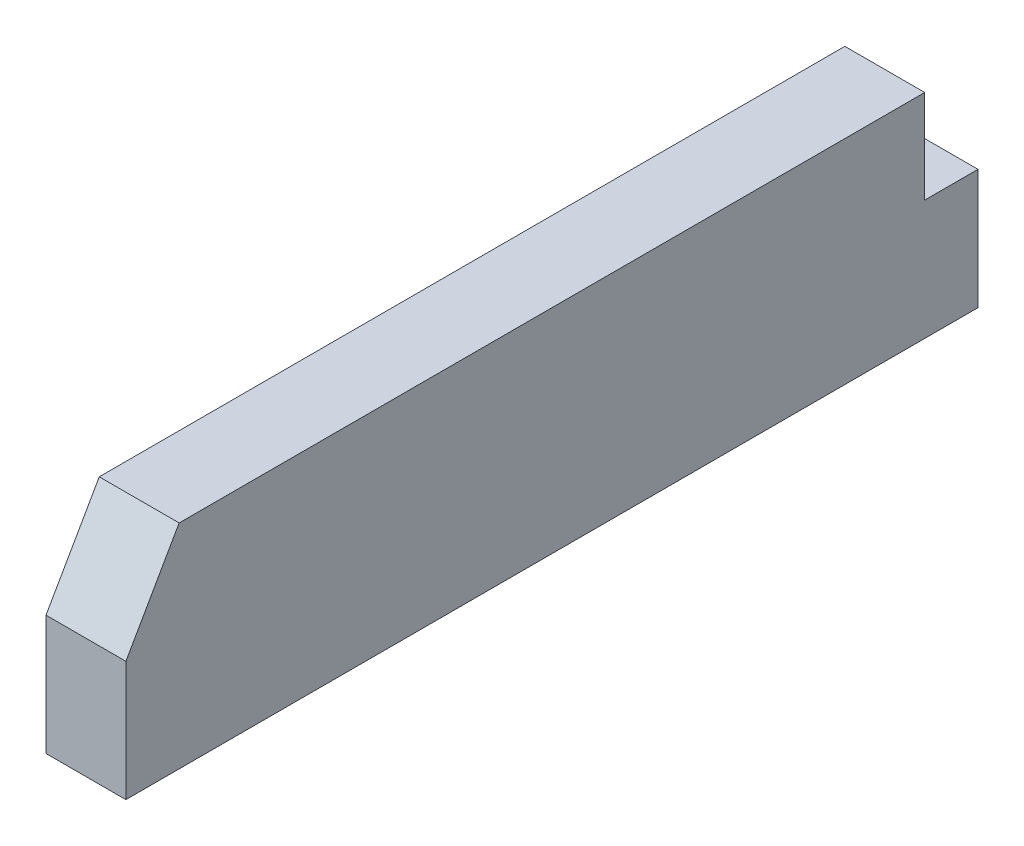
ISO-10303-21;
HEADER;
FILE_DESCRIPTION(('STEP AP214'),'2;1');
FILE_NAME('part.step','',(''),(''),'','','');
FILE_SCHEMA(('AUTOMOTIVE_DESIGN { 1 0 10303 214 1 1 1 1 }'));
ENDSEC;
DATA;
#1=APPLICATION_CONTEXT('core data for automotive mechanical design processes');
#2=APPLICATION_PROTOCOL_DEFINITION('international standard','automotive_design',2000,#1);
#3=PRODUCT_CONTEXT('',#1,'mechanical');
#4=PRODUCT('Part','Part','',(#3));
#5=PRODUCT_RELATED_PRODUCT_CATEGORY('part','',(#4));
#6=PRODUCT_DEFINITION_FORMATION('','',#4);
#7=PRODUCT_DEFINITION_CONTEXT('part definition',#1,'design');
#8=PRODUCT_DEFINITION('design','',#6,#7);
#9=PRODUCT_DEFINITION_SHAPE('','',#8);
#10=(LENGTH_UNIT() NAMED_UNIT(*) SI_UNIT(.MILLI.,.METRE.));
#11=(NAMED_UNIT(*) PLANE_ANGLE_UNIT() SI_UNIT($,.RADIAN.));
#12=(NAMED_UNIT(*) SI_UNIT($,.STERADIAN.) SOLID_ANGLE_UNIT());
#13=UNCERTAINTY_MEASURE_WITH_UNIT(LENGTH_MEASURE(1.E-05),#10,'distance_accuracy_value','');
#14=(GEOMETRIC_REPRESENTATION_CONTEXT(3) GLOBAL_UNCERTAINTY_ASSIGNED_CONTEXT((#13)) GLOBAL_UNIT_ASSIGNED_CONTEXT((#10,
#11,#12)) REPRESENTATION_CONTEXT('',''));
#15=CARTESIAN_POINT('',(0.,0.,0.));
#16=DIRECTION('',(0.,0.,1.));
#17=DIRECTION('',(1.,0.,0.));
#18=AXIS2_PLACEMENT_3D('',#15,#16,#17);
#19=CARTESIAN_POINT('',(9.525,-11.1125,0.));
#20=DIRECTION('',(0.,0.,1.));
#21=DIRECTION('',(1.,0.,0.));
#22=AXIS2_PLACEMENT_3D('',#19,#20,#21);
#23=PLANE('',#22);
#24=DIRECTION('',(0.,1.,0.));
#25=VECTOR('',#24,1.);
#26=CARTESIAN_POINT('',(0.,-11.1125,0.));
#27=LINE('',#26,#25);
#28=CARTESIAN_POINT('',(0.,-11.1125,0.));
#29=VERTEX_POINT('',#28);
#30=CARTESIAN_POINT('',(0.,0.,0.));
#31=VERTEX_POINT('',#30);
#32=EDGE_CURVE('E134',#29,#31,#27,.T.);
#33=ORIENTED_EDGE('',*,*,#32,.T.);
#34=DIRECTION('',(-1.,0.,0.));
#35=VECTOR('',#34,1.);
#36=CARTESIAN_POINT('',(9.525,0.,0.));
#37=LINE('',#36,#35);
#38=CARTESIAN_POINT('',(9.525,0.,0.));
#39=VERTEX_POINT('',#38);
#40=EDGE_CURVE('E11',#39,#31,#37,.T.);
#41=ORIENTED_EDGE('',*,*,#40,.F.);
#42=DIRECTION('',(0.,1.,0.));
#43=VECTOR('',#42,1.);
#44=CARTESIAN_POINT('',(9.525,-11.1125,0.));
#45=LINE('',#44,#43);
#46=CARTESIAN_POINT('',(9.525,-11.1125,0.));
#47=VERTEX_POINT('',#46);
#48=EDGE_CURVE('E153',#47,#39,#45,.T.);
#49=ORIENTED_EDGE('',*,*,#48,.F.);
#50=DIRECTION('',(-1.,0.,0.));
#51=VECTOR('',#50,1.);
#52=CARTESIAN_POINT('',(9.525,-11.1125,0.));
#53=LINE('',#52,#51);
#54=EDGE_CURVE('E130',#47,#29,#53,.T.);
#55=ORIENTED_EDGE('',*,*,#54,.T.);
#56=EDGE_LOOP('',(#33,#41,#49,#55));
#57=FACE_BOUND('',#56,.T.);
#58=ADVANCED_FACE('F39',(#57),#23,.F.);
#59=CARTESIAN_POINT('',(9.525,0.,0.));
#60=DIRECTION('',(0.,-1.,0.));
#61=DIRECTION('',(0.,0.,-1.));
#62=AXIS2_PLACEMENT_3D('',#59,#60,#61);
#63=PLANE('',#62);
#64=DIRECTION('',(0.,0.,1.));
#65=VECTOR('',#64,1.);
#66=CARTESIAN_POINT('',(0.,0.,0.));
#67=LINE('',#66,#65);
#68=CARTESIAN_POINT('',(0.,0.,88.9));
#69=VERTEX_POINT('',#68);
#70=EDGE_CURVE('E138',#31,#69,#67,.T.);
#71=ORIENTED_EDGE('',*,*,#70,.T.);
#72=DIRECTION('',(-1.,0.,0.));
#73=VECTOR('',#72,1.);
#74=CARTESIAN_POINT('',(9.525,0.,88.9));
#75=LINE('',#74,#73);
#76=CARTESIAN_POINT('',(9.525,0.,88.9));
#77=VERTEX_POINT('',#76);
#78=EDGE_CURVE('E48',#77,#69,#75,.T.);
#79=ORIENTED_EDGE('',*,*,#78,.F.);
#80=DIRECTION('',(0.,0.,1.));
#81=VECTOR('',#80,1.);
#82=CARTESIAN_POINT('',(9.525,0.,0.));
#83=LINE('',#82,#81);
#84=EDGE_CURVE('E96',#39,#77,#83,.T.);
#85=ORIENTED_EDGE('',*,*,#84,.F.);
#86=ORIENTED_EDGE('',*,*,#40,.T.);
#87=EDGE_LOOP('',(#71,#79,#85,#86));
#88=FACE_BOUND('',#87,.T.);
#89=ADVANCED_FACE('F187',(#88),#63,.F.);
#90=CARTESIAN_POINT('',(9.525,0.,88.9));
#91=DIRECTION('',(0.,-0.496138938356833,-0.868243142124459));
#92=DIRECTION('',(0.,0.868243142124459,-0.496138938356833));
#93=AXIS2_PLACEMENT_3D('',#90,#91,#92);
#94=PLANE('',#93);
#95=DIRECTION('',(0.,-0.86824314212446,0.496138938356834));
#96=VECTOR('',#95,1.);
#97=CARTESIAN_POINT('',(0.,0.,88.9));
#98=LINE('',#97,#96);
#99=CARTESIAN_POINT('',(0.,-11.1125,95.25));
#100=VERTEX_POINT('',#99);
#101=EDGE_CURVE('E141',#69,#100,#98,.T.);
#102=ORIENTED_EDGE('',*,*,#101,.T.);
#103=DIRECTION('',(-1.,0.,0.));
#104=VECTOR('',#103,1.);
#105=CARTESIAN_POINT('',(9.525,-11.1125,95.25));
#106=LINE('',#105,#104);
#107=CARTESIAN_POINT('',(9.525,-11.1125,95.25));
#108=VERTEX_POINT('',#107);
#109=EDGE_CURVE('E160',#108,#100,#106,.T.);
#110=ORIENTED_EDGE('',*,*,#109,.F.);
#111=DIRECTION('',(0.,-0.86824314212446,0.496138938356834));
#112=VECTOR('',#111,1.);
#113=CARTESIAN_POINT('',(9.525,0.,88.9));
#114=LINE('',#113,#112);
#115=EDGE_CURVE('E170',#77,#108,#114,.T.);
#116=ORIENTED_EDGE('',*,*,#115,.F.);
#117=ORIENTED_EDGE('',*,*,#78,.T.);
#118=EDGE_LOOP('',(#102,#110,#116,#117));
#119=FACE_BOUND('',#118,.T.);
#120=ADVANCED_FACE('F168',(#119),#94,.F.);
#121=CARTESIAN_POINT('',(9.525,-11.1125,95.25));
#122=DIRECTION('',(0.,0.,-1.));
#123=DIRECTION('',(-1.,0.,0.));
#124=AXIS2_PLACEMENT_3D('',#121,#122,#123);
#125=PLANE('',#124);
#126=DIRECTION('',(0.,-1.,0.));
#127=VECTOR('',#126,1.);
#128=CARTESIAN_POINT('',(0.,-11.1125,95.25));
#129=LINE('',#128,#127);
#130=CARTESIAN_POINT('',(0.,-25.4,95.25));
#131=VERTEX_POINT('',#130);
#132=EDGE_CURVE('E144',#100,#131,#129,.T.);
#133=ORIENTED_EDGE('',*,*,#132,.T.);
#134=DIRECTION('',(-1.,0.,0.));
#135=VECTOR('',#134,1.);
#136=CARTESIAN_POINT('',(9.525,-25.4,95.25));
#137=LINE('',#136,#135);
#138=CARTESIAN_POINT('',(9.525,-25.4,95.25));
#139=VERTEX_POINT('',#138);
#140=EDGE_CURVE('E123',#139,#131,#137,.T.);
#141=ORIENTED_EDGE('',*,*,#140,.F.);
#142=DIRECTION('',(0.,-1.,0.));
#143=VECTOR('',#142,1.);
#144=CARTESIAN_POINT('',(9.525,-11.1125,95.25));
#145=LINE('',#144,#143);
#146=EDGE_CURVE('E112',#108,#139,#145,.T.);
#147=ORIENTED_EDGE('',*,*,#146,.F.);
#148=ORIENTED_EDGE('',*,*,#109,.T.);
#149=EDGE_LOOP('',(#133,#141,#147,#148));
#150=FACE_BOUND('',#149,.T.);
#151=ADVANCED_FACE('F176',(#150),#125,.F.);
#152=CARTESIAN_POINT('',(9.525,-25.4,95.25));
#153=DIRECTION('',(0.,1.,0.));
#154=DIRECTION('',(0.,0.,1.));
#155=AXIS2_PLACEMENT_3D('',#152,#153,#154);
#156=PLANE('',#155);
#157=DIRECTION('',(0.,0.,-1.));
#158=VECTOR('',#157,1.);
#159=CARTESIAN_POINT('',(0.,-25.4,95.25));
#160=LINE('',#159,#158);
#161=CARTESIAN_POINT('',(0.,-25.4,-6.35000000000001));
#162=VERTEX_POINT('',#161);
#163=EDGE_CURVE('E121',#131,#162,#160,.T.);
#164=ORIENTED_EDGE('',*,*,#163,.T.);
#165=DIRECTION('',(-1.,0.,0.));
#166=VECTOR('',#165,1.);
#167=CARTESIAN_POINT('',(9.525,-25.4,-6.35000000000001));
#168=LINE('',#167,#166);
#169=CARTESIAN_POINT('',(9.525,-25.4,-6.35000000000001));
#170=VERTEX_POINT('',#169);
#171=EDGE_CURVE('E118',#170,#162,#168,.T.);
#172=ORIENTED_EDGE('',*,*,#171,.F.);
#173=DIRECTION('',(0.,0.,-1.));
#174=VECTOR('',#173,1.);
#175=CARTESIAN_POINT('',(9.525,-25.4,95.25));
#176=LINE('',#175,#174);
#177=EDGE_CURVE('E106',#139,#170,#176,.T.);
#178=ORIENTED_EDGE('',*,*,#177,.F.);
#179=ORIENTED_EDGE('',*,*,#140,.T.);
#180=EDGE_LOOP('',(#164,#172,#178,#179));
#181=FACE_BOUND('',#180,.T.);
#182=ADVANCED_FACE('F119',(#181),#156,.F.);
#183=CARTESIAN_POINT('',(9.525,-25.4,-6.35000000000001));
#184=DIRECTION('',(0.,0.,1.));
#185=DIRECTION('',(1.,0.,0.));
#186=AXIS2_PLACEMENT_3D('',#183,#184,#185);
#187=PLANE('',#186);
#188=DIRECTION('',(0.,1.,0.));
#189=VECTOR('',#188,1.);
#190=CARTESIAN_POINT('',(0.,-25.4,-6.35000000000001));
#191=LINE('',#190,#189);
#192=CARTESIAN_POINT('',(0.,-11.1125,-6.35000000000001));
#193=VERTEX_POINT('',#192);
#194=EDGE_CURVE('E82',#162,#193,#191,.T.);
#195=ORIENTED_EDGE('',*,*,#194,.T.);
#196=DIRECTION('',(-1.,0.,0.));
#197=VECTOR('',#196,1.);
#198=CARTESIAN_POINT('',(9.525,-11.1125,-6.35000000000001));
#199=LINE('',#198,#197);
#200=CARTESIAN_POINT('',(9.525,-11.1125,-6.35000000000001));
#201=VERTEX_POINT('',#200);
#202=EDGE_CURVE('E124',#201,#193,#199,.T.);
#203=ORIENTED_EDGE('',*,*,#202,.F.);
#204=DIRECTION('',(0.,1.,0.));
#205=VECTOR('',#204,1.);
#206=CARTESIAN_POINT('',(9.525,-25.4,-6.35000000000001));
#207=LINE('',#206,#205);
#208=EDGE_CURVE('E110',#170,#201,#207,.T.);
#209=ORIENTED_EDGE('',*,*,#208,.F.);
#210=ORIENTED_EDGE('',*,*,#171,.T.);
#211=EDGE_LOOP('',(#195,#203,#209,#210));
#212=FACE_BOUND('',#211,.T.);
#213=ADVANCED_FACE('F126',(#212),#187,.F.);
#214=CARTESIAN_POINT('',(9.525,-11.1125,-6.35000000000001));
#215=DIRECTION('',(0.,-1.,0.));
#216=DIRECTION('',(0.,0.,-1.));
#217=AXIS2_PLACEMENT_3D('',#214,#215,#216);
#218=PLANE('',#217);
#219=DIRECTION('',(0.,0.,1.));
#220=VECTOR('',#219,1.);
#221=CARTESIAN_POINT('',(0.,-11.1125,-6.35000000000001));
#222=LINE('',#221,#220);
#223=EDGE_CURVE('E88',#193,#29,#222,.T.);
#224=ORIENTED_EDGE('',*,*,#223,.T.);
#225=ORIENTED_EDGE('',*,*,#54,.F.);
#226=DIRECTION('',(0.,0.,1.));
#227=VECTOR('',#226,1.);
#228=CARTESIAN_POINT('',(9.525,-11.1125,-6.35000000000001));
#229=LINE('',#228,#227);
#230=EDGE_CURVE('E56',#201,#47,#229,.T.);
#231=ORIENTED_EDGE('',*,*,#230,.F.);
#232=ORIENTED_EDGE('',*,*,#202,.T.);
#233=EDGE_LOOP('',(#224,#225,#231,#232));
#234=FACE_BOUND('',#233,.T.);
#235=ADVANCED_FACE('F201',(#234),#218,.F.);
#236=CARTESIAN_POINT('',(9.525,0.,0.));
#237=DIRECTION('',(1.,0.,0.));
#238=DIRECTION('',(0.,0.,-1.));
#239=AXIS2_PLACEMENT_3D('',#236,#237,#238);
#240=PLANE('',#239);
#241=ORIENTED_EDGE('',*,*,#48,.T.);
#242=ORIENTED_EDGE('',*,*,#84,.T.);
#243=ORIENTED_EDGE('',*,*,#115,.T.);
#244=ORIENTED_EDGE('',*,*,#146,.T.);
#245=ORIENTED_EDGE('',*,*,#177,.T.);
#246=ORIENTED_EDGE('',*,*,#208,.T.);
#247=ORIENTED_EDGE('',*,*,#230,.T.);
#248=EDGE_LOOP('',(#241,#242,#243,#244,#245,#246,#247));
#249=FACE_BOUND('',#248,.T.);
#250=ADVANCED_FACE('F108',(#249),#240,.T.);
#251=CARTESIAN_POINT('',(0.,0.,0.));
#252=DIRECTION('',(1.,0.,0.));
#253=DIRECTION('',(0.,0.,-1.));
#254=AXIS2_PLACEMENT_3D('',#251,#252,#253);
#255=PLANE('',#254);
#256=ORIENTED_EDGE('',*,*,#32,.F.);
#257=ORIENTED_EDGE('',*,*,#223,.F.);
#258=ORIENTED_EDGE('',*,*,#194,.F.);
#259=ORIENTED_EDGE('',*,*,#163,.F.);
#260=ORIENTED_EDGE('',*,*,#132,.F.);
#261=ORIENTED_EDGE('',*,*,#101,.F.);
#262=ORIENTED_EDGE('',*,*,#70,.F.);
#263=EDGE_LOOP('',(#256,#257,#258,#259,#260,#261,#262));
#264=FACE_BOUND('',#263,.T.);
#265=ADVANCED_FACE('F174',(#264),#255,.F.);
#266=CLOSED_SHELL('',(#58,#89,#120,#151,#182,#213,#235,#250,#265));
#267=MANIFOLD_SOLID_BREP('B2',#266);
#268=ADVANCED_BREP_SHAPE_REPRESENTATION('',(#18,#267),#14);
#269=SHAPE_DEFINITION_REPRESENTATION(#9,#268);
ENDSEC;
END-ISO-10303-21;
